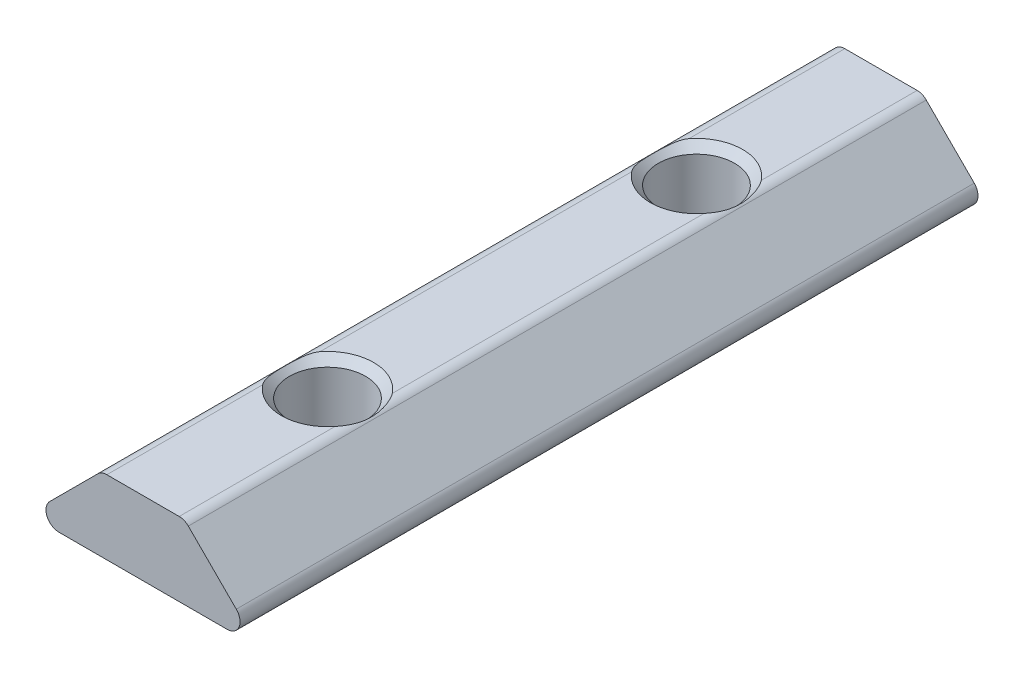
ISO-10303-21;
HEADER;
FILE_DESCRIPTION(('STEP AP214'),'2;1');
FILE_NAME('part.step','',(''),(''),'','','');
FILE_SCHEMA(('AUTOMOTIVE_DESIGN { 1 0 10303 214 1 1 1 1 }'));
ENDSEC;
DATA;
#1=APPLICATION_CONTEXT('core data for automotive mechanical design processes');
#2=APPLICATION_PROTOCOL_DEFINITION('international standard','automotive_design',2000,#1);
#3=PRODUCT_CONTEXT('',#1,'mechanical');
#4=PRODUCT('Part','Part','',(#3));
#5=PRODUCT_RELATED_PRODUCT_CATEGORY('part','',(#4));
#6=PRODUCT_DEFINITION_FORMATION('','',#4);
#7=PRODUCT_DEFINITION_CONTEXT('part definition',#1,'design');
#8=PRODUCT_DEFINITION('design','',#6,#7);
#9=PRODUCT_DEFINITION_SHAPE('','',#8);
#10=(LENGTH_UNIT() NAMED_UNIT(*) SI_UNIT(.MILLI.,.METRE.));
#11=(NAMED_UNIT(*) PLANE_ANGLE_UNIT() SI_UNIT($,.RADIAN.));
#12=(NAMED_UNIT(*) SI_UNIT($,.STERADIAN.) SOLID_ANGLE_UNIT());
#13=UNCERTAINTY_MEASURE_WITH_UNIT(LENGTH_MEASURE(1.E-05),#10,'distance_accuracy_value','');
#14=(GEOMETRIC_REPRESENTATION_CONTEXT(3) GLOBAL_UNCERTAINTY_ASSIGNED_CONTEXT((#13)) GLOBAL_UNIT_ASSIGNED_CONTEXT((#10,
#11,#12)) REPRESENTATION_CONTEXT('',''));
#15=CARTESIAN_POINT('',(0.,0.,0.));
#16=DIRECTION('',(0.,0.,1.));
#17=DIRECTION('',(1.,0.,0.));
#18=AXIS2_PLACEMENT_3D('',#15,#16,#17);
#19=CARTESIAN_POINT('',(1.96005050633883,3.3,20.));
#20=DIRECTION('',(0.,0.,-1.));
#21=DIRECTION('',(-1.,0.,0.));
#22=AXIS2_PLACEMENT_3D('',#19,#20,#21);
#23=CYLINDRICAL_SURFACE('',#22,0.699999999999998);
#24=CARTESIAN_POINT('',(1.91035303165574,3.99823360060235,-8.39011726587856));
#25=CARTESIAN_POINT('',(1.93077595602458,3.99966205349346,-8.4121302455375));
#26=CARTESIAN_POINT('',(1.95010381164606,4.00016309776282,-8.43513055765393));
#27=CARTESIAN_POINT('',(1.98671394400544,3.99973707612548,-8.48258656310038));
#28=CARTESIAN_POINT('',(2.00400258625831,3.99881458807567,-8.50703734902494));
#29=CARTESIAN_POINT('',(2.03661407660228,3.99598865106274,-8.5567275692868));
#30=CARTESIAN_POINT('',(2.05195768352095,3.99409688640372,-8.58195431957037));
#31=CARTESIAN_POINT('',(2.08110885508605,3.98961033921892,-8.63324789630082));
#32=CARTESIAN_POINT('',(2.09491480328415,3.98701482654461,-8.65931557033141));
#33=CARTESIAN_POINT('',(2.13390539753094,3.97858663896121,-8.73778346308049));
#34=CARTESIAN_POINT('',(2.15708041249845,3.97206269557331,-8.79110950659761));
#35=CARTESIAN_POINT('',(2.19895381291011,3.9583365791705,-8.89938776796351));
#36=CARTESIAN_POINT('',(2.21764991085327,3.95113406219529,-8.95434080072949));
#37=CARTESIAN_POINT('',(2.25138315080915,3.93676097795193,-9.06594666975105));
#38=CARTESIAN_POINT('',(2.26638296792493,3.92959140143797,-9.12261083519624));
#39=CARTESIAN_POINT('',(2.29297292883698,3.91594189516996,-9.23682013661848));
#40=CARTESIAN_POINT('',(2.3045621018668,3.90946216209931,-9.29436551852115));
#41=CARTESIAN_POINT('',(2.33037442954134,3.89430607624886,-9.44284319103402));
#42=CARTESIAN_POINT('',(2.34238098346596,3.88645969674573,-9.53425328776695));
#43=CARTESIAN_POINT('',(2.35975103755694,3.874758413891,-9.71798180663751));
#44=CARTESIAN_POINT('',(2.36511162906361,3.8709052583274,-9.81030060867421));
#45=CARTESIAN_POINT('',(2.36952871112734,3.86774555883326,-9.99478256066094));
#46=CARTESIAN_POINT('',(2.36861130200412,3.86842019073872,-10.0869447636172));
#47=CARTESIAN_POINT('',(2.36047706645964,3.87418186480306,-10.2708225660884));
#48=CARTESIAN_POINT('',(2.35326297622871,3.87926699039859,-10.3625383421904));
#49=CARTESIAN_POINT('',(2.33634105670178,3.89030393723578,-10.5079716208107));
#50=CARTESIAN_POINT('',(2.32882413634836,3.89507206218667,-10.5620449535821));
#51=CARTESIAN_POINT('',(2.31119434880458,3.90564390450588,-10.6696620937939));
#52=CARTESIAN_POINT('',(2.30108181322158,3.91144748955834,-10.7232059679694));
#53=CARTESIAN_POINT('',(2.27797771260496,3.92377462887755,-10.8297224940113));
#54=CARTESIAN_POINT('',(2.26497962444834,3.93029979732111,-10.8826935618361));
#55=CARTESIAN_POINT('',(2.23576568924423,3.94361236505547,-10.987683776296));
#56=CARTESIAN_POINT('',(2.21955080242931,3.95039968560666,-11.0397032019527));
#57=CARTESIAN_POINT('',(2.1763877746288,3.9662790242029,-11.1625441709061));
#58=CARTESIAN_POINT('',(2.1477176559163,3.97524113046693,-11.2328126575648));
#59=CARTESIAN_POINT('',(2.09804505623695,3.98646721590617,-11.3349664173962));
#60=CARTESIAN_POINT('',(2.08043626656241,3.98983321889633,-11.3683848988241));
#61=CARTESIAN_POINT('',(2.04265378861894,3.99537270294109,-11.4338296690707));
#62=CARTESIAN_POINT('',(2.02248280330216,3.99754742805634,-11.4658573779669));
#63=CARTESIAN_POINT('',(1.98705708229338,3.99961498960063,-11.516660294457));
#64=CARTESIAN_POINT('',(1.9726798353368,4.00004989145853,-11.5360216053164));
#65=CARTESIAN_POINT('',(1.9425604069729,3.99994166161384,-11.5737708960887));
#66=CARTESIAN_POINT('',(1.92681296058243,3.99939458310414,-11.5921546410248));
#67=CARTESIAN_POINT('',(1.91035303165574,3.99823360060235,-11.6098827341214));
#68=B_SPLINE_CURVE_WITH_KNOTS('',3,(#24,#25,#26,#27,#28,#29,#30,#31,#32,#33,#34,#35,#36,#37,#38,
#39,#40,#41,#42,#43,#44,#45,#46,#47,#48,#49,#50,#51,#52,#53,#54,#55,#56,#57,#58,#59,#60,#61,#62,
#63,#64,#65,#66,#67),.UNSPECIFIED.,.F.,.F.,(4,2,2,2,2,2,2,2,2,2,2,2,2,2,2,2,2,2,2,2,2,4),(0.,
0.0900413962660749,0.179793836363457,0.26848894148571,0.357276423507523,0.532514927905218,
0.707842741329137,0.884874456376142,1.06195651106551,1.3391786838115,1.61652214232291,
1.89271326864279,2.16878443725018,2.33312450297393,2.49744358358699,2.66213797903509,
2.82678328604887,3.05544101980551,3.1691193946255,3.28267882681612,3.35496747034216,
3.42754730959146),.UNSPECIFIED.);
#69=CARTESIAN_POINT('',(1.9600505063388,4.,-8.44816173117138));
#70=VERTEX_POINT('',#69);
#71=CARTESIAN_POINT('',(1.9600505063388,4.,-11.5518382688286));
#72=VERTEX_POINT('',#71);
#73=EDGE_CURVE('E57',#70,#72,#68,.T.);
#74=ORIENTED_EDGE('',*,*,#73,.F.);
#75=DIRECTION('',(0.,0.,-1.));
#76=VECTOR('',#75,1.);
#77=CARTESIAN_POINT('',(1.9600505063388,4.,20.));
#78=LINE('',#77,#76);
#79=CARTESIAN_POINT('',(1.9600505063388,4.,8.44816173117138));
#80=VERTEX_POINT('',#79);
#81=EDGE_CURVE('E140',#80,#70,#78,.T.);
#82=ORIENTED_EDGE('',*,*,#81,.F.);
#83=CARTESIAN_POINT('',(1.91035303165574,3.99823360060235,11.6098827341214));
#84=CARTESIAN_POINT('',(1.93077595602458,3.99966205349346,11.5878697544625));
#85=CARTESIAN_POINT('',(1.95010381164606,4.00016309776282,11.5648694423461));
#86=CARTESIAN_POINT('',(1.98671394400544,3.99973707612548,11.5174134368996));
#87=CARTESIAN_POINT('',(2.00400258625832,3.99881458807567,11.4929626509751));
#88=CARTESIAN_POINT('',(2.03661407660228,3.99598865106275,11.4432724307132));
#89=CARTESIAN_POINT('',(2.05195768352095,3.99409688640372,11.4180456804296));
#90=CARTESIAN_POINT('',(2.08110885508605,3.98961033921892,11.3667521036992));
#91=CARTESIAN_POINT('',(2.09491480328415,3.98701482654461,11.3406844296686));
#92=CARTESIAN_POINT('',(2.13390539753094,3.97858663896121,11.2622165369195));
#93=CARTESIAN_POINT('',(2.15708041249845,3.97206269557331,11.2088904934024));
#94=CARTESIAN_POINT('',(2.19895381291011,3.9583365791705,11.1006122320365));
#95=CARTESIAN_POINT('',(2.21764991085327,3.95113406219529,11.0456591992705));
#96=CARTESIAN_POINT('',(2.25138315080915,3.93676097795193,10.9340533302489));
#97=CARTESIAN_POINT('',(2.26638296792493,3.92959140143797,10.8773891648038));
#98=CARTESIAN_POINT('',(2.29297292883698,3.91594189516996,10.7631798633815));
#99=CARTESIAN_POINT('',(2.3045621018668,3.90946216209931,10.7056344814789));
#100=CARTESIAN_POINT('',(2.33037442954134,3.89430607624886,10.557156808966));
#101=CARTESIAN_POINT('',(2.34238098346595,3.88645969674574,10.465746712233));
#102=CARTESIAN_POINT('',(2.35975103755694,3.874758413891,10.2820181933625));
#103=CARTESIAN_POINT('',(2.36511162906361,3.8709052583274,10.1896993913258));
#104=CARTESIAN_POINT('',(2.36952871112734,3.86774555883326,10.0052174393391));
#105=CARTESIAN_POINT('',(2.36861130200412,3.86842019073872,9.91305523638282));
#106=CARTESIAN_POINT('',(2.36047706645964,3.87418186480306,9.72917743391161));
#107=CARTESIAN_POINT('',(2.35326297622871,3.87926699039859,9.63746165780957));
#108=CARTESIAN_POINT('',(2.33634105670178,3.89030393723578,9.49202837918931));
#109=CARTESIAN_POINT('',(2.32882413634836,3.89507206218667,9.4379550464179));
#110=CARTESIAN_POINT('',(2.31119434880458,3.90564390450588,9.33033790620608));
#111=CARTESIAN_POINT('',(2.30108181322158,3.91144748955834,9.27679403203059));
#112=CARTESIAN_POINT('',(2.27797771260495,3.92377462887755,9.17027750598867));
#113=CARTESIAN_POINT('',(2.26497962444834,3.93029979732111,9.1173064381639));
#114=CARTESIAN_POINT('',(2.23576568924423,3.94361236505547,9.01231622370399));
#115=CARTESIAN_POINT('',(2.2195508024293,3.95039968560666,8.96029679804726));
#116=CARTESIAN_POINT('',(2.1763877746288,3.96627902420291,8.83745582909391));
#117=CARTESIAN_POINT('',(2.1477176559163,3.97524113046693,8.76718734243518));
#118=CARTESIAN_POINT('',(2.09804505623695,3.98646721590617,8.66503358260383));
#119=CARTESIAN_POINT('',(2.08043626656241,3.98983321889633,8.63161510117591));
#120=CARTESIAN_POINT('',(2.04265378861894,3.99537270294109,8.56617033092926));
#121=CARTESIAN_POINT('',(2.02248280330216,3.99754742805634,8.53414262203307));
#122=CARTESIAN_POINT('',(1.98705708229338,3.99961498960063,8.48333970554304));
#123=CARTESIAN_POINT('',(1.9726798353368,4.00004989145853,8.46397839468363));
#124=CARTESIAN_POINT('',(1.9425604069729,3.99994166161384,8.42622910391131));
#125=CARTESIAN_POINT('',(1.92681296058243,3.99939458310414,8.40784535897516));
#126=CARTESIAN_POINT('',(1.91035303165574,3.99823360060235,8.39011726587856));
#127=B_SPLINE_CURVE_WITH_KNOTS('',3,(#83,#84,#85,#86,#87,#88,#89,#90,#91,#92,#93,#94,#95,#96,
#97,#98,#99,#100,#101,#102,#103,#104,#105,#106,#107,#108,#109,#110,#111,#112,#113,#114,#115,
#116,#117,#118,#119,#120,#121,#122,#123,#124,#125,#126),.UNSPECIFIED.,.F.,.F.,(4,2,2,2,2,2,2,2,
2,2,2,2,2,2,2,2,2,2,2,2,2,4),(0.,0.0900413962660771,0.179793836363459,0.268488941485712,
0.357276423507523,0.532514927905218,0.707842741329141,0.884874456376144,1.06195651106551,
1.3391786838115,1.6165221423229,1.89271326864279,2.16878443725018,2.33312450297394,
2.49744358358699,2.6621379790351,2.82678328604887,3.05544101980551,3.1691193946255,
3.28267882681612,3.35496747034216,3.42754730959146),.UNSPECIFIED.);
#128=CARTESIAN_POINT('',(1.9600505063388,4.,11.5518382688286));
#129=VERTEX_POINT('',#128);
#130=EDGE_CURVE('E183',#129,#80,#127,.T.);
#131=ORIENTED_EDGE('',*,*,#130,.F.);
#132=CARTESIAN_POINT('',(1.9600505063388,4.,20.));
#133=VERTEX_POINT('',#132);
#134=EDGE_CURVE('E146',#133,#129,#78,.T.);
#135=ORIENTED_EDGE('',*,*,#134,.F.);
#136=CARTESIAN_POINT('',(1.96005050633883,3.3,20.));
#137=DIRECTION('',(0.,0.,1.));
#138=DIRECTION('',(1.,0.,0.));
#139=AXIS2_PLACEMENT_3D('',#136,#137,#138);
#140=CIRCLE('',#139,0.699999999999998);
#141=CARTESIAN_POINT('',(2.4550252531694,3.7949747468306,20.));
#142=VERTEX_POINT('',#141);
#143=EDGE_CURVE('E251',#142,#133,#140,.T.);
#144=ORIENTED_EDGE('',*,*,#143,.F.);
#145=DIRECTION('',(0.,0.,-1.));
#146=VECTOR('',#145,1.);
#147=CARTESIAN_POINT('',(2.4550252531694,3.7949747468306,20.));
#148=LINE('',#147,#146);
#149=CARTESIAN_POINT('',(2.4550252531694,3.7949747468306,-20.));
#150=VERTEX_POINT('',#149);
#151=EDGE_CURVE('E149',#142,#150,#148,.T.);
#152=ORIENTED_EDGE('',*,*,#151,.T.);
#153=CARTESIAN_POINT('',(1.96005050633883,3.3,-20.));
#154=DIRECTION('',(0.,0.,1.));
#155=DIRECTION('',(1.,0.,0.));
#156=AXIS2_PLACEMENT_3D('',#153,#154,#155);
#157=CIRCLE('',#156,0.699999999999998);
#158=CARTESIAN_POINT('',(1.9600505063388,4.,-20.));
#159=VERTEX_POINT('',#158);
#160=EDGE_CURVE('E301',#150,#159,#157,.T.);
#161=ORIENTED_EDGE('',*,*,#160,.T.);
#162=EDGE_CURVE('E142',#72,#159,#78,.T.);
#163=ORIENTED_EDGE('',*,*,#162,.F.);
#164=EDGE_LOOP('',(#74,#82,#131,#135,#144,#152,#161,#163));
#165=FACE_BOUND('',#164,.T.);
#166=ADVANCED_FACE('F43',(#165),#23,.T.);
#167=CARTESIAN_POINT('',(-1.96005050633884,3.3,20.));
#168=DIRECTION('',(0.,0.,-1.));
#169=DIRECTION('',(-1.,0.,0.));
#170=AXIS2_PLACEMENT_3D('',#167,#168,#169);
#171=CYLINDRICAL_SURFACE('',#170,0.699999999999997);
#172=CARTESIAN_POINT('',(-1.91035303165574,3.99823360060235,-11.6098827341214));
#173=CARTESIAN_POINT('',(-1.93077595602458,3.99966205349346,-11.5878697544625));
#174=CARTESIAN_POINT('',(-1.95010381164606,4.00016309776282,-11.5648694423461));
#175=CARTESIAN_POINT('',(-1.98671394400544,3.99973707612548,-11.5174134368996));
#176=CARTESIAN_POINT('',(-2.00400258625831,3.99881458807567,-11.4929626509751));
#177=CARTESIAN_POINT('',(-2.03661407660228,3.99598865106275,-11.4432724307132));
#178=CARTESIAN_POINT('',(-2.05195768352095,3.99409688640372,-11.4180456804296));
#179=CARTESIAN_POINT('',(-2.08110885508605,3.98961033921892,-11.3667521036992));
#180=CARTESIAN_POINT('',(-2.09491480328414,3.98701482654461,-11.3406844296686));
#181=CARTESIAN_POINT('',(-2.13390539753094,3.97858663896121,-11.2622165369195));
#182=CARTESIAN_POINT('',(-2.15708041249845,3.97206269557331,-11.2088904934024));
#183=CARTESIAN_POINT('',(-2.19895381291011,3.9583365791705,-11.1006122320365));
#184=CARTESIAN_POINT('',(-2.21764991085327,3.95113406219529,-11.0456591992705));
#185=CARTESIAN_POINT('',(-2.25138315080915,3.93676097795193,-10.9340533302489));
#186=CARTESIAN_POINT('',(-2.26638296792493,3.92959140143797,-10.8773891648038));
#187=CARTESIAN_POINT('',(-2.29297292883698,3.91594189516996,-10.7631798633815));
#188=CARTESIAN_POINT('',(-2.3045621018668,3.90946216209931,-10.7056344814789));
#189=CARTESIAN_POINT('',(-2.33037442954134,3.89430607624886,-10.557156808966));
#190=CARTESIAN_POINT('',(-2.34238098346596,3.88645969674574,-10.465746712233));
#191=CARTESIAN_POINT('',(-2.35975103755694,3.874758413891,-10.2820181933625));
#192=CARTESIAN_POINT('',(-2.36511162906361,3.8709052583274,-10.1896993913258));
#193=CARTESIAN_POINT('',(-2.36952871112734,3.86774555883326,-10.0052174393391));
#194=CARTESIAN_POINT('',(-2.36861130200412,3.86842019073872,-9.91305523638282));
#195=CARTESIAN_POINT('',(-2.36047706645964,3.87418186480306,-9.72917743391161));
#196=CARTESIAN_POINT('',(-2.35326297622871,3.87926699039859,-9.63746165780957));
#197=CARTESIAN_POINT('',(-2.33634105670178,3.89030393723578,-9.49202837918931));
#198=CARTESIAN_POINT('',(-2.32882413634836,3.89507206218667,-9.43795504641789));
#199=CARTESIAN_POINT('',(-2.31119434880458,3.90564390450588,-9.33033790620608));
#200=CARTESIAN_POINT('',(-2.30108181322158,3.91144748955834,-9.27679403203058));
#201=CARTESIAN_POINT('',(-2.27797771260495,3.92377462887755,-9.17027750598867));
#202=CARTESIAN_POINT('',(-2.26497962444834,3.93029979732111,-9.1173064381639));
#203=CARTESIAN_POINT('',(-2.23576568924423,3.94361236505547,-9.01231622370399));
#204=CARTESIAN_POINT('',(-2.2195508024293,3.95039968560666,-8.96029679804726));
#205=CARTESIAN_POINT('',(-2.1763877746288,3.96627902420291,-8.83745582909391));
#206=CARTESIAN_POINT('',(-2.1477176559163,3.97524113046693,-8.76718734243518));
#207=CARTESIAN_POINT('',(-2.09804505623695,3.98646721590618,-8.66503358260382));
#208=CARTESIAN_POINT('',(-2.08043626656241,3.98983321889633,-8.63161510117591));
#209=CARTESIAN_POINT('',(-2.04265378861894,3.99537270294109,-8.56617033092926));
#210=CARTESIAN_POINT('',(-2.02248280330216,3.99754742805634,-8.53414262203307));
#211=CARTESIAN_POINT('',(-1.98705708229338,3.99961498960063,-8.48333970554304));
#212=CARTESIAN_POINT('',(-1.9726798353368,4.00004989145853,-8.46397839468363));
#213=CARTESIAN_POINT('',(-1.9425604069729,3.99994166161384,-8.42622910391131));
#214=CARTESIAN_POINT('',(-1.92681296058243,3.99939458310414,-8.40784535897516));
#215=CARTESIAN_POINT('',(-1.91035303165574,3.99823360060235,-8.39011726587857));
#216=B_SPLINE_CURVE_WITH_KNOTS('',3,(#172,#173,#174,#175,#176,#177,#178,#179,#180,#181,#182,
#183,#184,#185,#186,#187,#188,#189,#190,#191,#192,#193,#194,#195,#196,#197,#198,#199,#200,#201,
#202,#203,#204,#205,#206,#207,#208,#209,#210,#211,#212,#213,#214,#215),.UNSPECIFIED.,.F.,.F.,(4,
2,2,2,2,2,2,2,2,2,2,2,2,2,2,2,2,2,2,2,2,4),(0.,0.0900413962660749,0.179793836363459,
0.26848894148571,0.357276423507522,0.53251492790522,0.707842741329141,0.884874456376144,
1.06195651106551,1.3391786838115,1.61652214232291,1.8927132686428,2.16878443725019,
2.33312450297394,2.49744358358699,2.6621379790351,2.82678328604888,3.05544101980551,
3.16911939462551,3.28267882681613,3.35496747034216,3.42754730959146),.UNSPECIFIED.);
#217=CARTESIAN_POINT('',(-1.9600505063388,4.,-11.5518382688286));
#218=VERTEX_POINT('',#217);
#219=CARTESIAN_POINT('',(-1.9600505063388,4.,-8.44816173117138));
#220=VERTEX_POINT('',#219);
#221=EDGE_CURVE('E131',#218,#220,#216,.T.);
#222=ORIENTED_EDGE('',*,*,#221,.F.);
#223=DIRECTION('',(0.,0.,-1.));
#224=VECTOR('',#223,1.);
#225=CARTESIAN_POINT('',(-1.9600505063388,4.,20.));
#226=LINE('',#225,#224);
#227=CARTESIAN_POINT('',(-1.9600505063388,4.,-20.));
#228=VERTEX_POINT('',#227);
#229=EDGE_CURVE('E262',#218,#228,#226,.T.);
#230=ORIENTED_EDGE('',*,*,#229,.T.);
#231=CARTESIAN_POINT('',(-1.96005050633884,3.3,-20.));
#232=DIRECTION('',(0.,0.,1.));
#233=DIRECTION('',(1.,0.,0.));
#234=AXIS2_PLACEMENT_3D('',#231,#232,#233);
#235=CIRCLE('',#234,0.699999999999997);
#236=CARTESIAN_POINT('',(-2.4550252531694,3.7949747468306,-20.));
#237=VERTEX_POINT('',#236);
#238=EDGE_CURVE('E288',#228,#237,#235,.T.);
#239=ORIENTED_EDGE('',*,*,#238,.T.);
#240=DIRECTION('',(0.,0.,-1.));
#241=VECTOR('',#240,1.);
#242=CARTESIAN_POINT('',(-2.4550252531694,3.7949747468306,20.));
#243=LINE('',#242,#241);
#244=CARTESIAN_POINT('',(-2.4550252531694,3.7949747468306,20.));
#245=VERTEX_POINT('',#244);
#246=EDGE_CURVE('E261',#245,#237,#243,.T.);
#247=ORIENTED_EDGE('',*,*,#246,.F.);
#248=CARTESIAN_POINT('',(-1.96005050633884,3.3,20.));
#249=DIRECTION('',(0.,0.,1.));
#250=DIRECTION('',(1.,0.,0.));
#251=AXIS2_PLACEMENT_3D('',#248,#249,#250);
#252=CIRCLE('',#251,0.699999999999997);
#253=CARTESIAN_POINT('',(-1.9600505063388,4.,20.));
#254=VERTEX_POINT('',#253);
#255=EDGE_CURVE('E250',#254,#245,#252,.T.);
#256=ORIENTED_EDGE('',*,*,#255,.F.);
#257=CARTESIAN_POINT('',(-1.96005050633884,4.,11.5518382688286));
#258=VERTEX_POINT('',#257);
#259=EDGE_CURVE('E150',#254,#258,#226,.T.);
#260=ORIENTED_EDGE('',*,*,#259,.T.);
#261=CARTESIAN_POINT('',(-1.91035303165574,3.99823360060235,8.39011726587856));
#262=CARTESIAN_POINT('',(-1.93077595602458,3.99966205349346,8.4121302455375));
#263=CARTESIAN_POINT('',(-1.95010381164606,4.00016309776282,8.43513055765393));
#264=CARTESIAN_POINT('',(-1.98671394400544,3.99973707612548,8.48258656310038));
#265=CARTESIAN_POINT('',(-2.00400258625832,3.99881458807567,8.50703734902494));
#266=CARTESIAN_POINT('',(-2.03661407660228,3.99598865106274,8.5567275692868));
#267=CARTESIAN_POINT('',(-2.05195768352095,3.99409688640372,8.58195431957037));
#268=CARTESIAN_POINT('',(-2.08110885508605,3.98961033921892,8.63324789630082));
#269=CARTESIAN_POINT('',(-2.09491480328414,3.98701482654461,8.65931557033141));
#270=CARTESIAN_POINT('',(-2.13390539753094,3.97858663896121,8.73778346308048));
#271=CARTESIAN_POINT('',(-2.15708041249845,3.97206269557331,8.79110950659761));
#272=CARTESIAN_POINT('',(-2.1989538129101,3.9583365791705,8.8993877679635));
#273=CARTESIAN_POINT('',(-2.21764991085327,3.95113406219529,8.95434080072948));
#274=CARTESIAN_POINT('',(-2.25138315080914,3.93676097795193,9.06594666975105));
#275=CARTESIAN_POINT('',(-2.26638296792493,3.92959140143797,9.12261083519624));
#276=CARTESIAN_POINT('',(-2.29297292883698,3.91594189516996,9.23682013661848));
#277=CARTESIAN_POINT('',(-2.3045621018668,3.90946216209931,9.29436551852115));
#278=CARTESIAN_POINT('',(-2.33037442954134,3.89430607624886,9.44284319103402));
#279=CARTESIAN_POINT('',(-2.34238098346596,3.88645969674574,9.53425328776695));
#280=CARTESIAN_POINT('',(-2.35975103755694,3.874758413891,9.71798180663751));
#281=CARTESIAN_POINT('',(-2.36511162906361,3.8709052583274,9.81030060867421));
#282=CARTESIAN_POINT('',(-2.36952871112734,3.86774555883326,9.99478256066094));
#283=CARTESIAN_POINT('',(-2.36861130200412,3.86842019073872,10.0869447636172));
#284=CARTESIAN_POINT('',(-2.36047706645964,3.87418186480306,10.2708225660884));
#285=CARTESIAN_POINT('',(-2.35326297622871,3.87926699039859,10.3625383421904));
#286=CARTESIAN_POINT('',(-2.33634105670178,3.89030393723578,10.5079716208107));
#287=CARTESIAN_POINT('',(-2.32882413634836,3.89507206218667,10.5620449535821));
#288=CARTESIAN_POINT('',(-2.31119434880458,3.90564390450588,10.6696620937939));
#289=CARTESIAN_POINT('',(-2.30108181322158,3.91144748955834,10.7232059679694));
#290=CARTESIAN_POINT('',(-2.27797771260495,3.92377462887755,10.8297224940113));
#291=CARTESIAN_POINT('',(-2.26497962444834,3.93029979732111,10.8826935618361));
#292=CARTESIAN_POINT('',(-2.23576568924423,3.94361236505547,10.987683776296));
#293=CARTESIAN_POINT('',(-2.2195508024293,3.95039968560666,11.0397032019527));
#294=CARTESIAN_POINT('',(-2.1763877746288,3.96627902420291,11.1625441709061));
#295=CARTESIAN_POINT('',(-2.1477176559163,3.97524113046693,11.2328126575648));
#296=CARTESIAN_POINT('',(-2.09804505623695,3.98646721590618,11.3349664173962));
#297=CARTESIAN_POINT('',(-2.08043626656241,3.98983321889633,11.3683848988241));
#298=CARTESIAN_POINT('',(-2.04265378861894,3.99537270294109,11.4338296690707));
#299=CARTESIAN_POINT('',(-2.02248280330216,3.99754742805634,11.4658573779669));
#300=CARTESIAN_POINT('',(-1.98705708229338,3.99961498960063,11.516660294457));
#301=CARTESIAN_POINT('',(-1.9726798353368,4.00004989145853,11.5360216053164));
#302=CARTESIAN_POINT('',(-1.9425604069729,3.99994166161384,11.5737708960887));
#303=CARTESIAN_POINT('',(-1.92681296058243,3.99939458310414,11.5921546410248));
#304=CARTESIAN_POINT('',(-1.91035303165574,3.99823360060235,11.6098827341214));
#305=B_SPLINE_CURVE_WITH_KNOTS('',3,(#261,#262,#263,#264,#265,#266,#267,#268,#269,#270,#271,
#272,#273,#274,#275,#276,#277,#278,#279,#280,#281,#282,#283,#284,#285,#286,#287,#288,#289,#290,
#291,#292,#293,#294,#295,#296,#297,#298,#299,#300,#301,#302,#303,#304),.UNSPECIFIED.,.F.,.F.,(4,
2,2,2,2,2,2,2,2,2,2,2,2,2,2,2,2,2,2,2,2,4),(0.,0.0900413962660749,0.179793836363459,
0.268488941485708,0.357276423507522,0.532514927905216,0.707842741329133,0.884874456376141,
1.06195651106551,1.3391786838115,1.61652214232291,1.89271326864279,2.16878443725019,
2.33312450297394,2.49744358358699,2.6621379790351,2.82678328604888,3.05544101980551,
3.1691193946255,3.28267882681613,3.35496747034216,3.42754730959146),.UNSPECIFIED.);
#306=CARTESIAN_POINT('',(-1.9600505063388,4.,8.44816173117138));
#307=VERTEX_POINT('',#306);
#308=EDGE_CURVE('E160',#307,#258,#305,.T.);
#309=ORIENTED_EDGE('',*,*,#308,.F.);
#310=EDGE_CURVE('E268',#307,#220,#226,.T.);
#311=ORIENTED_EDGE('',*,*,#310,.T.);
#312=EDGE_LOOP('',(#222,#230,#239,#247,#256,#260,#309,#311));
#313=FACE_BOUND('',#312,.T.);
#314=ADVANCED_FACE('F167',(#313),#171,.T.);
#315=CARTESIAN_POINT('',(1.9600505063388,4.,20.));
#316=DIRECTION('',(0.,-1.,0.));
#317=DIRECTION('',(0.,0.,-1.));
#318=AXIS2_PLACEMENT_3D('',#315,#316,#317);
#319=PLANE('',#318);
#320=CARTESIAN_POINT('',(0.,4.,-10.));
#321=DIRECTION('',(0.,-1.,0.));
#322=DIRECTION('',(0.,0.,-1.));
#323=AXIS2_PLACEMENT_3D('',#320,#321,#322);
#324=CIRCLE('',#323,2.5);
#325=EDGE_CURVE('E11',#220,#70,#324,.F.);
#326=ORIENTED_EDGE('',*,*,#325,.F.);
#327=ORIENTED_EDGE('',*,*,#310,.F.);
#328=CARTESIAN_POINT('',(0.,4.,10.));
#329=DIRECTION('',(0.,1.,0.));
#330=DIRECTION('',(0.,0.,1.));
#331=AXIS2_PLACEMENT_3D('',#328,#329,#330);
#332=CIRCLE('',#331,2.5);
#333=EDGE_CURVE('E65',#80,#307,#332,.T.);
#334=ORIENTED_EDGE('',*,*,#333,.F.);
#335=ORIENTED_EDGE('',*,*,#81,.T.);
#336=EDGE_LOOP('',(#326,#327,#334,#335));
#337=FACE_BOUND('',#336,.T.);
#338=ADVANCED_FACE('F145',(#337),#319,.F.);
#339=EDGE_CURVE('E192',#258,#129,#332,.T.);
#340=ORIENTED_EDGE('',*,*,#339,.F.);
#341=ORIENTED_EDGE('',*,*,#259,.F.);
#342=DIRECTION('',(-1.,0.,0.));
#343=VECTOR('',#342,1.);
#344=CARTESIAN_POINT('',(1.9600505063388,4.,20.));
#345=LINE('',#344,#343);
#346=EDGE_CURVE('E247',#133,#254,#345,.T.);
#347=ORIENTED_EDGE('',*,*,#346,.F.);
#348=ORIENTED_EDGE('',*,*,#134,.T.);
#349=EDGE_LOOP('',(#340,#341,#347,#348));
#350=FACE_BOUND('',#349,.T.);
#351=ADVANCED_FACE('F246',(#350),#319,.F.);
#352=CARTESIAN_POINT('',(-4.56005050633878,0.70000000000002,20.));
#353=DIRECTION('',(0.,0.,-1.));
#354=DIRECTION('',(-1.,0.,0.));
#355=AXIS2_PLACEMENT_3D('',#352,#353,#354);
#356=CYLINDRICAL_SURFACE('',#355,0.70000000000002);
#357=DIRECTION('',(0.,0.,-1.));
#358=VECTOR('',#357,1.);
#359=CARTESIAN_POINT('',(-5.0550252531694,1.1949747468306,20.));
#360=LINE('',#359,#358);
#361=CARTESIAN_POINT('',(-5.0550252531694,1.1949747468306,20.));
#362=VERTEX_POINT('',#361);
#363=CARTESIAN_POINT('',(-5.0550252531694,1.1949747468306,-20.));
#364=VERTEX_POINT('',#363);
#365=EDGE_CURVE('E260',#362,#364,#360,.T.);
#366=ORIENTED_EDGE('',*,*,#365,.T.);
#367=CARTESIAN_POINT('',(-4.56005050633878,0.70000000000002,-20.));
#368=DIRECTION('',(0.,0.,1.));
#369=DIRECTION('',(1.,0.,0.));
#370=AXIS2_PLACEMENT_3D('',#367,#368,#369);
#371=CIRCLE('',#370,0.70000000000002);
#372=CARTESIAN_POINT('',(-4.5600505063388,0.,-20.));
#373=VERTEX_POINT('',#372);
#374=EDGE_CURVE('E191',#364,#373,#371,.T.);
#375=ORIENTED_EDGE('',*,*,#374,.T.);
#376=DIRECTION('',(0.,0.,-1.));
#377=VECTOR('',#376,1.);
#378=CARTESIAN_POINT('',(-4.5600505063388,0.,20.));
#379=LINE('',#378,#377);
#380=CARTESIAN_POINT('',(-4.5600505063388,0.,20.));
#381=VERTEX_POINT('',#380);
#382=EDGE_CURVE('E159',#381,#373,#379,.T.);
#383=ORIENTED_EDGE('',*,*,#382,.F.);
#384=CARTESIAN_POINT('',(-4.56005050633878,0.70000000000002,20.));
#385=DIRECTION('',(0.,0.,1.));
#386=DIRECTION('',(1.,0.,0.));
#387=AXIS2_PLACEMENT_3D('',#384,#385,#386);
#388=CIRCLE('',#387,0.70000000000002);
#389=EDGE_CURVE('E276',#362,#381,#388,.T.);
#390=ORIENTED_EDGE('',*,*,#389,.F.);
#391=EDGE_LOOP('',(#366,#375,#383,#390));
#392=FACE_BOUND('',#391,.T.);
#393=ADVANCED_FACE('F45',(#392),#356,.T.);
#394=CARTESIAN_POINT('',(-4.5600505063388,0.,20.));
#395=DIRECTION('',(0.,1.,0.));
#396=DIRECTION('',(0.,0.,1.));
#397=AXIS2_PLACEMENT_3D('',#394,#395,#396);
#398=PLANE('',#397);
#399=CARTESIAN_POINT('',(0.,0.,-10.));
#400=DIRECTION('',(0.,1.,0.));
#401=DIRECTION('',(0.,0.,1.));
#402=AXIS2_PLACEMENT_3D('',#399,#400,#401);
#403=CIRCLE('',#402,2.5);
#404=CARTESIAN_POINT('',(0.,0.,-7.5));
#405=VERTEX_POINT('',#404);
#406=EDGE_CURVE('E329',#405,#405,#403,.T.);
#407=ORIENTED_EDGE('',*,*,#406,.T.);
#408=EDGE_LOOP('',(#407));
#409=FACE_BOUND('',#408,.T.);
#410=CARTESIAN_POINT('',(0.,0.,10.));
#411=DIRECTION('',(0.,1.,0.));
#412=DIRECTION('',(0.,0.,1.));
#413=AXIS2_PLACEMENT_3D('',#410,#411,#412);
#414=CIRCLE('',#413,2.5);
#415=CARTESIAN_POINT('',(0.,0.,12.5));
#416=VERTEX_POINT('',#415);
#417=EDGE_CURVE('E143',#416,#416,#414,.T.);
#418=ORIENTED_EDGE('',*,*,#417,.T.);
#419=EDGE_LOOP('',(#418));
#420=FACE_BOUND('',#419,.T.);
#421=ORIENTED_EDGE('',*,*,#382,.T.);
#422=DIRECTION('',(1.,0.,0.));
#423=VECTOR('',#422,1.);
#424=CARTESIAN_POINT('',(-4.5600505063388,0.,-20.));
#425=LINE('',#424,#423);
#426=CARTESIAN_POINT('',(4.5600505063388,0.,-20.));
#427=VERTEX_POINT('',#426);
#428=EDGE_CURVE('E315',#373,#427,#425,.T.);
#429=ORIENTED_EDGE('',*,*,#428,.T.);
#430=DIRECTION('',(0.,0.,-1.));
#431=VECTOR('',#430,1.);
#432=CARTESIAN_POINT('',(4.5600505063388,0.,20.));
#433=LINE('',#432,#431);
#434=CARTESIAN_POINT('',(4.5600505063388,0.,20.));
#435=VERTEX_POINT('',#434);
#436=EDGE_CURVE('E157',#435,#427,#433,.T.);
#437=ORIENTED_EDGE('',*,*,#436,.F.);
#438=DIRECTION('',(1.,0.,0.));
#439=VECTOR('',#438,1.);
#440=CARTESIAN_POINT('',(-4.5600505063388,0.,20.));
#441=LINE('',#440,#439);
#442=EDGE_CURVE('E284',#381,#435,#441,.T.);
#443=ORIENTED_EDGE('',*,*,#442,.F.);
#444=EDGE_LOOP('',(#421,#429,#437,#443));
#445=FACE_BOUND('',#444,.T.);
#446=ADVANCED_FACE('F320',(#409,#420,#445),#398,.F.);
#447=CARTESIAN_POINT('',(4.56005050633878,0.70000000000002,20.));
#448=DIRECTION('',(0.,0.,-1.));
#449=DIRECTION('',(-1.,0.,0.));
#450=AXIS2_PLACEMENT_3D('',#447,#448,#449);
#451=CYLINDRICAL_SURFACE('',#450,0.70000000000002);
#452=ORIENTED_EDGE('',*,*,#436,.T.);
#453=CARTESIAN_POINT('',(4.56005050633878,0.70000000000002,-20.));
#454=DIRECTION('',(0.,0.,1.));
#455=DIRECTION('',(1.,0.,0.));
#456=AXIS2_PLACEMENT_3D('',#453,#454,#455);
#457=CIRCLE('',#456,0.70000000000002);
#458=CARTESIAN_POINT('',(5.0550252531694,1.1949747468306,-20.));
#459=VERTEX_POINT('',#458);
#460=EDGE_CURVE('E310',#427,#459,#457,.T.);
#461=ORIENTED_EDGE('',*,*,#460,.T.);
#462=DIRECTION('',(0.,0.,-1.));
#463=VECTOR('',#462,1.);
#464=CARTESIAN_POINT('',(5.0550252531694,1.1949747468306,20.));
#465=LINE('',#464,#463);
#466=CARTESIAN_POINT('',(5.0550252531694,1.1949747468306,20.));
#467=VERTEX_POINT('',#466);
#468=EDGE_CURVE('E155',#467,#459,#465,.T.);
#469=ORIENTED_EDGE('',*,*,#468,.F.);
#470=CARTESIAN_POINT('',(4.56005050633878,0.70000000000002,20.));
#471=DIRECTION('',(0.,0.,1.));
#472=DIRECTION('',(1.,0.,0.));
#473=AXIS2_PLACEMENT_3D('',#470,#471,#472);
#474=CIRCLE('',#473,0.70000000000002);
#475=EDGE_CURVE('E286',#435,#467,#474,.T.);
#476=ORIENTED_EDGE('',*,*,#475,.F.);
#477=EDGE_LOOP('',(#452,#461,#469,#476));
#478=FACE_BOUND('',#477,.T.);
#479=ADVANCED_FACE('F319',(#478),#451,.T.);
#480=CARTESIAN_POINT('',(5.0550252531694,1.1949747468306,20.));
#481=DIRECTION('',(-0.707106781186548,-0.707106781186547,0.));
#482=DIRECTION('',(0.707106781186547,-0.707106781186548,0.));
#483=AXIS2_PLACEMENT_3D('',#480,#481,#482);
#484=PLANE('',#483);
#485=ORIENTED_EDGE('',*,*,#468,.T.);
#486=DIRECTION('',(-0.707106781186547,0.707106781186548,0.));
#487=VECTOR('',#486,1.);
#488=CARTESIAN_POINT('',(5.0550252531694,1.1949747468306,-20.));
#489=LINE('',#488,#487);
#490=EDGE_CURVE('E299',#459,#150,#489,.T.);
#491=ORIENTED_EDGE('',*,*,#490,.T.);
#492=ORIENTED_EDGE('',*,*,#151,.F.);
#493=DIRECTION('',(-0.707106781186547,0.707106781186548,0.));
#494=VECTOR('',#493,1.);
#495=CARTESIAN_POINT('',(5.0550252531694,1.1949747468306,20.));
#496=LINE('',#495,#494);
#497=EDGE_CURVE('E255',#467,#142,#496,.T.);
#498=ORIENTED_EDGE('',*,*,#497,.F.);
#499=EDGE_LOOP('',(#485,#491,#492,#498));
#500=FACE_BOUND('',#499,.T.);
#501=ADVANCED_FACE('F199',(#500),#484,.F.);
#502=EDGE_CURVE('E47',#72,#218,#324,.F.);
#503=ORIENTED_EDGE('',*,*,#502,.F.);
#504=ORIENTED_EDGE('',*,*,#162,.T.);
#505=DIRECTION('',(-1.,0.,0.));
#506=VECTOR('',#505,1.);
#507=CARTESIAN_POINT('',(1.9600505063388,4.,-20.));
#508=LINE('',#507,#506);
#509=EDGE_CURVE('E307',#159,#228,#508,.T.);
#510=ORIENTED_EDGE('',*,*,#509,.T.);
#511=ORIENTED_EDGE('',*,*,#229,.F.);
#512=EDGE_LOOP('',(#503,#504,#510,#511));
#513=FACE_BOUND('',#512,.T.);
#514=ADVANCED_FACE('F198',(#513),#319,.F.);
#515=CARTESIAN_POINT('',(-2.4550252531694,3.7949747468306,20.));
#516=DIRECTION('',(0.707106781186548,-0.707106781186547,0.));
#517=DIRECTION('',(0.707106781186547,0.707106781186548,0.));
#518=AXIS2_PLACEMENT_3D('',#515,#516,#517);
#519=PLANE('',#518);
#520=ORIENTED_EDGE('',*,*,#246,.T.);
#521=DIRECTION('',(-0.707106781186547,-0.707106781186548,0.));
#522=VECTOR('',#521,1.);
#523=CARTESIAN_POINT('',(-2.4550252531694,3.7949747468306,-20.));
#524=LINE('',#523,#522);
#525=EDGE_CURVE('E280',#237,#364,#524,.T.);
#526=ORIENTED_EDGE('',*,*,#525,.T.);
#527=ORIENTED_EDGE('',*,*,#365,.F.);
#528=DIRECTION('',(-0.707106781186547,-0.707106781186548,0.));
#529=VECTOR('',#528,1.);
#530=CARTESIAN_POINT('',(-2.4550252531694,3.7949747468306,20.));
#531=LINE('',#530,#529);
#532=EDGE_CURVE('E253',#245,#362,#531,.T.);
#533=ORIENTED_EDGE('',*,*,#532,.F.);
#534=EDGE_LOOP('',(#520,#526,#527,#533));
#535=FACE_BOUND('',#534,.T.);
#536=ADVANCED_FACE('F278',(#535),#519,.F.);
#537=CARTESIAN_POINT('',(-4.56005050633878,0.70000000000002,20.));
#538=DIRECTION('',(0.,0.,1.));
#539=DIRECTION('',(1.,0.,0.));
#540=AXIS2_PLACEMENT_3D('',#537,#538,#539);
#541=PLANE('',#540);
#542=ORIENTED_EDGE('',*,*,#389,.T.);
#543=ORIENTED_EDGE('',*,*,#442,.T.);
#544=ORIENTED_EDGE('',*,*,#475,.T.);
#545=ORIENTED_EDGE('',*,*,#497,.T.);
#546=ORIENTED_EDGE('',*,*,#143,.T.);
#547=ORIENTED_EDGE('',*,*,#346,.T.);
#548=ORIENTED_EDGE('',*,*,#255,.T.);
#549=ORIENTED_EDGE('',*,*,#532,.T.);
#550=EDGE_LOOP('',(#542,#543,#544,#545,#546,#547,#548,#549));
#551=FACE_BOUND('',#550,.T.);
#552=ADVANCED_FACE('F273',(#551),#541,.T.);
#553=CARTESIAN_POINT('',(-4.56005050633878,0.70000000000002,-20.));
#554=DIRECTION('',(0.,0.,1.));
#555=DIRECTION('',(1.,0.,0.));
#556=AXIS2_PLACEMENT_3D('',#553,#554,#555);
#557=PLANE('',#556);
#558=ORIENTED_EDGE('',*,*,#374,.F.);
#559=ORIENTED_EDGE('',*,*,#525,.F.);
#560=ORIENTED_EDGE('',*,*,#238,.F.);
#561=ORIENTED_EDGE('',*,*,#509,.F.);
#562=ORIENTED_EDGE('',*,*,#160,.F.);
#563=ORIENTED_EDGE('',*,*,#490,.F.);
#564=ORIENTED_EDGE('',*,*,#460,.F.);
#565=ORIENTED_EDGE('',*,*,#428,.F.);
#566=EDGE_LOOP('',(#558,#559,#560,#561,#562,#563,#564,#565));
#567=FACE_BOUND('',#566,.T.);
#568=ADVANCED_FACE('F177',(#567),#557,.F.);
#569=CARTESIAN_POINT('',(0.,3.567,10.));
#570=DIRECTION('',(0.,1.,0.));
#571=DIRECTION('',(0.,0.,1.));
#572=AXIS2_PLACEMENT_3D('',#569,#570,#571);
#573=CONICAL_SURFACE('',#572,2.067,0.78539816339745);
#574=CARTESIAN_POINT('',(0.,3.567,10.));
#575=DIRECTION('',(0.,1.,0.));
#576=DIRECTION('',(0.,0.,1.));
#577=AXIS2_PLACEMENT_3D('',#574,#575,#576);
#578=CIRCLE('',#577,2.067);
#579=CARTESIAN_POINT('',(0.,3.567,12.067));
#580=VERTEX_POINT('',#579);
#581=EDGE_CURVE('E236',#580,#580,#578,.T.);
#582=ORIENTED_EDGE('',*,*,#581,.F.);
#583=EDGE_LOOP('',(#582));
#584=FACE_BOUND('',#583,.T.);
#585=ORIENTED_EDGE('',*,*,#130,.T.);
#586=ORIENTED_EDGE('',*,*,#333,.T.);
#587=ORIENTED_EDGE('',*,*,#308,.T.);
#588=ORIENTED_EDGE('',*,*,#339,.T.);
#589=EDGE_LOOP('',(#585,#586,#587,#588));
#590=FACE_BOUND('',#589,.T.);
#591=ADVANCED_FACE('F171',(#584,#590),#573,.F.);
#592=CARTESIAN_POINT('',(0.,0.,10.));
#593=DIRECTION('',(0.,1.,0.));
#594=DIRECTION('',(0.,0.,1.));
#595=AXIS2_PLACEMENT_3D('',#592,#593,#594);
#596=CYLINDRICAL_SURFACE('',#595,2.067);
#597=ORIENTED_EDGE('',*,*,#581,.T.);
#598=EDGE_LOOP('',(#597));
#599=FACE_BOUND('',#598,.T.);
#600=CARTESIAN_POINT('',(0.,0.433,10.));
#601=DIRECTION('',(0.,1.,0.));
#602=DIRECTION('',(0.,0.,1.));
#603=AXIS2_PLACEMENT_3D('',#600,#601,#602);
#604=CIRCLE('',#603,2.067);
#605=CARTESIAN_POINT('',(0.,0.433,12.067));
#606=VERTEX_POINT('',#605);
#607=EDGE_CURVE('E232',#606,#606,#604,.T.);
#608=ORIENTED_EDGE('',*,*,#607,.F.);
#609=EDGE_LOOP('',(#608));
#610=FACE_BOUND('',#609,.T.);
#611=ADVANCED_FACE('F176',(#599,#610),#596,.F.);
#612=CARTESIAN_POINT('',(0.,0.,10.));
#613=DIRECTION('',(0.,-1.,0.));
#614=DIRECTION('',(0.,0.,-1.));
#615=AXIS2_PLACEMENT_3D('',#612,#613,#614);
#616=CONICAL_SURFACE('',#615,2.5,0.78539816339745);
#617=ORIENTED_EDGE('',*,*,#607,.T.);
#618=EDGE_LOOP('',(#617));
#619=FACE_BOUND('',#618,.T.);
#620=ORIENTED_EDGE('',*,*,#417,.F.);
#621=EDGE_LOOP('',(#620));
#622=FACE_BOUND('',#621,.T.);
#623=ADVANCED_FACE('F219',(#619,#622),#616,.F.);
#624=CARTESIAN_POINT('',(0.,3.567,-10.));
#625=DIRECTION('',(0.,1.,0.));
#626=DIRECTION('',(0.,0.,1.));
#627=AXIS2_PLACEMENT_3D('',#624,#625,#626);
#628=CONICAL_SURFACE('',#627,2.067,0.78539816339745);
#629=CARTESIAN_POINT('',(0.,3.567,-10.));
#630=DIRECTION('',(0.,1.,0.));
#631=DIRECTION('',(0.,0.,1.));
#632=AXIS2_PLACEMENT_3D('',#629,#630,#631);
#633=CIRCLE('',#632,2.067);
#634=CARTESIAN_POINT('',(0.,3.567,-7.933));
#635=VERTEX_POINT('',#634);
#636=EDGE_CURVE('E334',#635,#635,#633,.T.);
#637=ORIENTED_EDGE('',*,*,#636,.F.);
#638=EDGE_LOOP('',(#637));
#639=FACE_BOUND('',#638,.T.);
#640=ORIENTED_EDGE('',*,*,#73,.T.);
#641=ORIENTED_EDGE('',*,*,#502,.T.);
#642=ORIENTED_EDGE('',*,*,#221,.T.);
#643=ORIENTED_EDGE('',*,*,#325,.T.);
#644=EDGE_LOOP('',(#640,#641,#642,#643));
#645=FACE_BOUND('',#644,.T.);
#646=ADVANCED_FACE('F129',(#639,#645),#628,.F.);
#647=CARTESIAN_POINT('',(0.,0.,-10.));
#648=DIRECTION('',(0.,1.,0.));
#649=DIRECTION('',(0.,0.,1.));
#650=AXIS2_PLACEMENT_3D('',#647,#648,#649);
#651=CYLINDRICAL_SURFACE('',#650,2.067);
#652=ORIENTED_EDGE('',*,*,#636,.T.);
#653=EDGE_LOOP('',(#652));
#654=FACE_BOUND('',#653,.T.);
#655=CARTESIAN_POINT('',(0.,0.433,-10.));
#656=DIRECTION('',(0.,1.,0.));
#657=DIRECTION('',(0.,0.,1.));
#658=AXIS2_PLACEMENT_3D('',#655,#656,#657);
#659=CIRCLE('',#658,2.067);
#660=CARTESIAN_POINT('',(0.,0.433,-7.933));
#661=VERTEX_POINT('',#660);
#662=EDGE_CURVE('E331',#661,#661,#659,.T.);
#663=ORIENTED_EDGE('',*,*,#662,.F.);
#664=EDGE_LOOP('',(#663));
#665=FACE_BOUND('',#664,.T.);
#666=ADVANCED_FACE('F218',(#654,#665),#651,.F.);
#667=CARTESIAN_POINT('',(0.,0.,-10.));
#668=DIRECTION('',(0.,-1.,0.));
#669=DIRECTION('',(0.,0.,-1.));
#670=AXIS2_PLACEMENT_3D('',#667,#668,#669);
#671=CONICAL_SURFACE('',#670,2.5,0.78539816339745);
#672=ORIENTED_EDGE('',*,*,#662,.T.);
#673=EDGE_LOOP('',(#672));
#674=FACE_BOUND('',#673,.T.);
#675=ORIENTED_EDGE('',*,*,#406,.F.);
#676=EDGE_LOOP('',(#675));
#677=FACE_BOUND('',#676,.T.);
#678=ADVANCED_FACE('F341',(#674,#677),#671,.F.);
#679=CLOSED_SHELL('',(#166,#314,#338,#351,#393,#446,#479,#501,#514,#536,#552,#568,#591,#611,
#623,#646,#666,#678));
#680=MANIFOLD_SOLID_BREP('B2',#679);
#681=ADVANCED_BREP_SHAPE_REPRESENTATION('',(#18,#680),#14);
#682=SHAPE_DEFINITION_REPRESENTATION(#9,#681);
ENDSEC;
END-ISO-10303-21;
